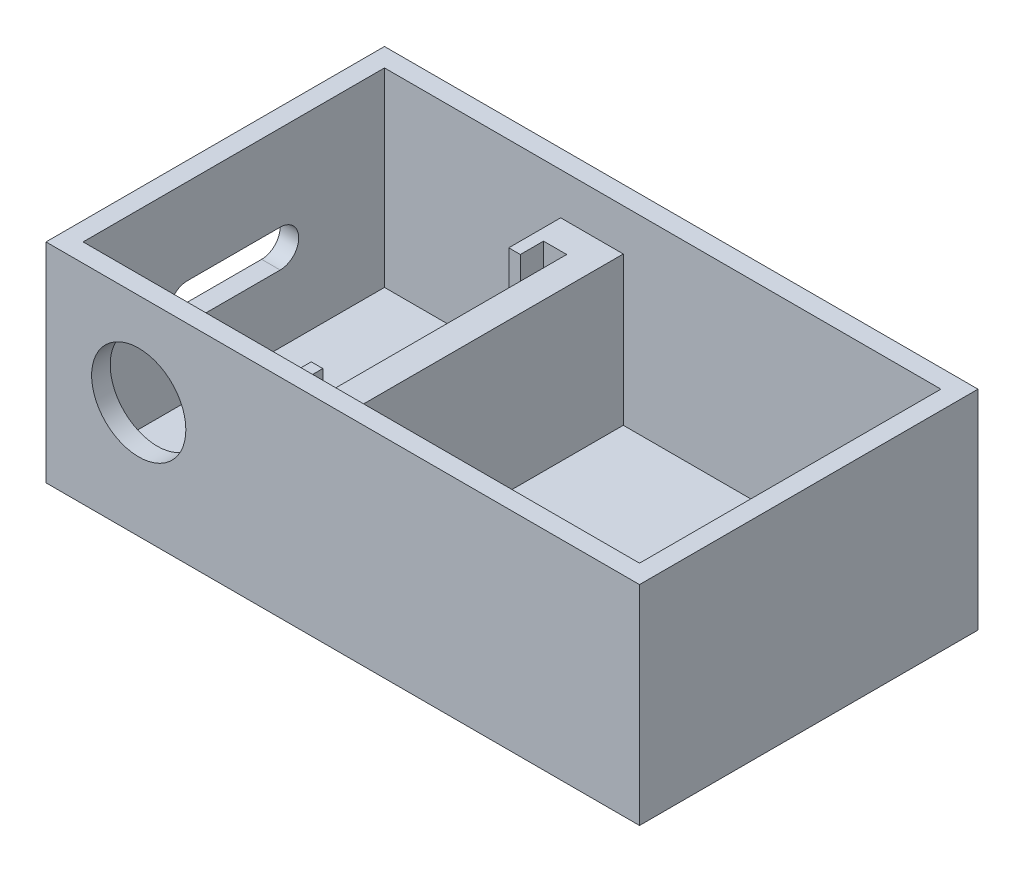
ISO-10303-21;
HEADER;
FILE_DESCRIPTION(('STEP AP214'),'2;1');
FILE_NAME('part.step','',(''),(''),'','','');
FILE_SCHEMA(('AUTOMOTIVE_DESIGN { 1 0 10303 214 1 1 1 1 }'));
ENDSEC;
DATA;
#1=APPLICATION_CONTEXT('core data for automotive mechanical design processes');
#2=APPLICATION_PROTOCOL_DEFINITION('international standard','automotive_design',2000,#1);
#3=PRODUCT_CONTEXT('',#1,'mechanical');
#4=PRODUCT('Part','Part','',(#3));
#5=PRODUCT_RELATED_PRODUCT_CATEGORY('part','',(#4));
#6=PRODUCT_DEFINITION_FORMATION('','',#4);
#7=PRODUCT_DEFINITION_CONTEXT('part definition',#1,'design');
#8=PRODUCT_DEFINITION('design','',#6,#7);
#9=PRODUCT_DEFINITION_SHAPE('','',#8);
#10=(LENGTH_UNIT() NAMED_UNIT(*) SI_UNIT(.MILLI.,.METRE.));
#11=(NAMED_UNIT(*) PLANE_ANGLE_UNIT() SI_UNIT($,.RADIAN.));
#12=(NAMED_UNIT(*) SI_UNIT($,.STERADIAN.) SOLID_ANGLE_UNIT());
#13=UNCERTAINTY_MEASURE_WITH_UNIT(LENGTH_MEASURE(1.E-05),#10,'distance_accuracy_value','');
#14=(GEOMETRIC_REPRESENTATION_CONTEXT(3) GLOBAL_UNCERTAINTY_ASSIGNED_CONTEXT((#13)) GLOBAL_UNIT_ASSIGNED_CONTEXT((#10,
#11,#12)) REPRESENTATION_CONTEXT('',''));
#15=CARTESIAN_POINT('',(0.,0.,0.));
#16=DIRECTION('',(0.,0.,1.));
#17=DIRECTION('',(1.,0.,0.));
#18=AXIS2_PLACEMENT_3D('',#15,#16,#17);
#19=CARTESIAN_POINT('',(0.,41.,-32.5));
#20=DIRECTION('',(0.,0.,1.));
#21=DIRECTION('',(1.,0.,0.));
#22=AXIS2_PLACEMENT_3D('',#19,#20,#21);
#23=PLANE('',#22);
#24=DIRECTION('',(-1.,0.,0.));
#25=VECTOR('',#24,1.);
#26=CARTESIAN_POINT('',(0.,0.,-32.5));
#27=LINE('',#26,#25);
#28=CARTESIAN_POINT('',(-22.,0.,-32.5));
#29=VERTEX_POINT('',#28);
#30=CARTESIAN_POINT('',(-60.,0.,-32.5));
#31=VERTEX_POINT('',#30);
#32=EDGE_CURVE('E351',#29,#31,#27,.T.);
#33=ORIENTED_EDGE('',*,*,#32,.F.);
#34=DIRECTION('',(0.,-1.,0.));
#35=VECTOR('',#34,1.);
#36=CARTESIAN_POINT('',(-22.,32.,-32.5));
#37=LINE('',#36,#35);
#38=CARTESIAN_POINT('',(-22.,32.,-32.5));
#39=VERTEX_POINT('',#38);
#40=EDGE_CURVE('E309',#39,#29,#37,.T.);
#41=ORIENTED_EDGE('',*,*,#40,.F.);
#42=DIRECTION('',(1.,0.,0.));
#43=VECTOR('',#42,1.);
#44=CARTESIAN_POINT('',(-14.5,32.,-32.5));
#45=LINE('',#44,#43);
#46=CARTESIAN_POINT('',(-8.50000000000001,32.,-32.5));
#47=VERTEX_POINT('',#46);
#48=EDGE_CURVE('E312',#39,#47,#45,.T.);
#49=ORIENTED_EDGE('',*,*,#48,.T.);
#50=DIRECTION('',(0.,-1.,0.));
#51=VECTOR('',#50,1.);
#52=CARTESIAN_POINT('',(-8.50000000000001,32.,-32.5));
#53=LINE('',#52,#51);
#54=CARTESIAN_POINT('',(-8.50000000000001,0.,-32.5));
#55=VERTEX_POINT('',#54);
#56=EDGE_CURVE('E324',#47,#55,#53,.T.);
#57=ORIENTED_EDGE('',*,*,#56,.T.);
#58=CARTESIAN_POINT('',(60.,0.,-32.5));
#59=VERTEX_POINT('',#58);
#60=EDGE_CURVE('E364',#59,#55,#27,.T.);
#61=ORIENTED_EDGE('',*,*,#60,.F.);
#62=DIRECTION('',(0.,-1.,0.));
#63=VECTOR('',#62,1.);
#64=CARTESIAN_POINT('',(60.,41.,-32.5));
#65=LINE('',#64,#63);
#66=CARTESIAN_POINT('',(60.,41.,-32.5));
#67=VERTEX_POINT('',#66);
#68=EDGE_CURVE('E363',#67,#59,#65,.T.);
#69=ORIENTED_EDGE('',*,*,#68,.F.);
#70=DIRECTION('',(-1.,0.,0.));
#71=VECTOR('',#70,1.);
#72=CARTESIAN_POINT('',(0.,41.,-32.5));
#73=LINE('',#72,#71);
#74=CARTESIAN_POINT('',(-60.,41.,-32.5));
#75=VERTEX_POINT('',#74);
#76=EDGE_CURVE('E352',#67,#75,#73,.T.);
#77=ORIENTED_EDGE('',*,*,#76,.T.);
#78=DIRECTION('',(0.,-1.,0.));
#79=VECTOR('',#78,1.);
#80=CARTESIAN_POINT('',(-60.,41.,-32.5));
#81=LINE('',#80,#79);
#82=EDGE_CURVE('E384',#75,#31,#81,.T.);
#83=ORIENTED_EDGE('',*,*,#82,.T.);
#84=EDGE_LOOP('',(#33,#41,#49,#57,#61,#69,#77,#83));
#85=FACE_BOUND('',#84,.T.);
#86=ADVANCED_FACE('F58',(#85),#23,.T.);
#87=CARTESIAN_POINT('',(0.,0.,0.));
#88=DIRECTION('',(0.,-1.,0.));
#89=DIRECTION('',(0.,0.,-1.));
#90=AXIS2_PLACEMENT_3D('',#87,#88,#89);
#91=PLANE('',#90);
#92=DIRECTION('',(0.,0.,1.));
#93=VECTOR('',#92,1.);
#94=CARTESIAN_POINT('',(-19.5,0.,21.3));
#95=LINE('',#94,#93);
#96=CARTESIAN_POINT('',(-19.5,0.,21.3));
#97=VERTEX_POINT('',#96);
#98=CARTESIAN_POINT('',(-19.5,0.,26.3));
#99=VERTEX_POINT('',#98);
#100=EDGE_CURVE('E261',#97,#99,#95,.T.);
#101=ORIENTED_EDGE('',*,*,#100,.T.);
#102=DIRECTION('',(1.,0.,0.));
#103=VECTOR('',#102,1.);
#104=CARTESIAN_POINT('',(-19.5,0.,26.3));
#105=LINE('',#104,#103);
#106=CARTESIAN_POINT('',(-14.5,0.,26.3));
#107=VERTEX_POINT('',#106);
#108=EDGE_CURVE('E258',#99,#107,#105,.T.);
#109=ORIENTED_EDGE('',*,*,#108,.T.);
#110=DIRECTION('',(0.,0.,1.));
#111=VECTOR('',#110,1.);
#112=CARTESIAN_POINT('',(-14.5,0.,-32.5));
#113=LINE('',#112,#111);
#114=CARTESIAN_POINT('',(-14.5,0.,-26.3));
#115=VERTEX_POINT('',#114);
#116=EDGE_CURVE('E316',#115,#107,#113,.T.);
#117=ORIENTED_EDGE('',*,*,#116,.F.);
#118=DIRECTION('',(1.,0.,0.));
#119=VECTOR('',#118,1.);
#120=CARTESIAN_POINT('',(-19.5,0.,-26.3));
#121=LINE('',#120,#119);
#122=CARTESIAN_POINT('',(-19.5,0.,-26.3));
#123=VERTEX_POINT('',#122);
#124=EDGE_CURVE('E284',#123,#115,#121,.T.);
#125=ORIENTED_EDGE('',*,*,#124,.F.);
#126=DIRECTION('',(0.,0.,-1.));
#127=VECTOR('',#126,1.);
#128=CARTESIAN_POINT('',(-19.5,0.,-21.3));
#129=LINE('',#128,#127);
#130=CARTESIAN_POINT('',(-19.5,0.,-21.3));
#131=VERTEX_POINT('',#130);
#132=EDGE_CURVE('E295',#131,#123,#129,.T.);
#133=ORIENTED_EDGE('',*,*,#132,.F.);
#134=DIRECTION('',(1.,0.,0.));
#135=VECTOR('',#134,1.);
#136=CARTESIAN_POINT('',(-22.,0.,-21.3));
#137=LINE('',#136,#135);
#138=CARTESIAN_POINT('',(-22.,0.,-21.3));
#139=VERTEX_POINT('',#138);
#140=EDGE_CURVE('E293',#139,#131,#137,.T.);
#141=ORIENTED_EDGE('',*,*,#140,.F.);
#142=DIRECTION('',(0.,0.,1.));
#143=VECTOR('',#142,1.);
#144=CARTESIAN_POINT('',(-22.,0.,-32.5));
#145=LINE('',#144,#143);
#146=EDGE_CURVE('E271',#29,#139,#145,.T.);
#147=ORIENTED_EDGE('',*,*,#146,.F.);
#148=ORIENTED_EDGE('',*,*,#32,.T.);
#149=DIRECTION('',(0.,0.,1.));
#150=VECTOR('',#149,1.);
#151=CARTESIAN_POINT('',(-60.,0.,0.));
#152=LINE('',#151,#150);
#153=CARTESIAN_POINT('',(-60.,0.,32.5));
#154=VERTEX_POINT('',#153);
#155=EDGE_CURVE('E367',#31,#154,#152,.T.);
#156=ORIENTED_EDGE('',*,*,#155,.T.);
#157=DIRECTION('',(-1.,0.,0.));
#158=VECTOR('',#157,1.);
#159=CARTESIAN_POINT('',(0.,0.,32.5));
#160=LINE('',#159,#158);
#161=CARTESIAN_POINT('',(-22.,0.,32.5));
#162=VERTEX_POINT('',#161);
#163=EDGE_CURVE('E370',#162,#154,#160,.T.);
#164=ORIENTED_EDGE('',*,*,#163,.F.);
#165=DIRECTION('',(0.,0.,-1.));
#166=VECTOR('',#165,1.);
#167=CARTESIAN_POINT('',(-22.,0.,32.5));
#168=LINE('',#167,#166);
#169=CARTESIAN_POINT('',(-22.,0.,21.3));
#170=VERTEX_POINT('',#169);
#171=EDGE_CURVE('E268',#162,#170,#168,.T.);
#172=ORIENTED_EDGE('',*,*,#171,.T.);
#173=DIRECTION('',(1.,0.,0.));
#174=VECTOR('',#173,1.);
#175=CARTESIAN_POINT('',(-22.,0.,21.3));
#176=LINE('',#175,#174);
#177=EDGE_CURVE('E265',#170,#97,#176,.T.);
#178=ORIENTED_EDGE('',*,*,#177,.T.);
#179=EDGE_LOOP('',(#101,#109,#117,#125,#133,#141,#147,#148,#156,#164,#172,#178));
#180=FACE_BOUND('',#179,.T.);
#181=ADVANCED_FACE('F429',(#180),#91,.F.);
#182=CARTESIAN_POINT('',(-14.5,32.,-32.5));
#183=DIRECTION('',(1.,0.,0.));
#184=DIRECTION('',(0.,0.,-1.));
#185=AXIS2_PLACEMENT_3D('',#182,#183,#184);
#186=PLANE('',#185);
#187=ORIENTED_EDGE('',*,*,#116,.T.);
#188=DIRECTION('',(0.,-1.,0.));
#189=VECTOR('',#188,1.);
#190=CARTESIAN_POINT('',(-14.5,32.,26.3));
#191=LINE('',#190,#189);
#192=CARTESIAN_POINT('',(-14.5,32.,26.3));
#193=VERTEX_POINT('',#192);
#194=EDGE_CURVE('E244',#193,#107,#191,.T.);
#195=ORIENTED_EDGE('',*,*,#194,.F.);
#196=DIRECTION('',(0.,0.,1.));
#197=VECTOR('',#196,1.);
#198=CARTESIAN_POINT('',(-14.5,32.,-32.5));
#199=LINE('',#198,#197);
#200=CARTESIAN_POINT('',(-14.5,32.,-26.3));
#201=VERTEX_POINT('',#200);
#202=EDGE_CURVE('E321',#201,#193,#199,.T.);
#203=ORIENTED_EDGE('',*,*,#202,.F.);
#204=DIRECTION('',(0.,-1.,0.));
#205=VECTOR('',#204,1.);
#206=CARTESIAN_POINT('',(-14.5,32.,-26.3));
#207=LINE('',#206,#205);
#208=EDGE_CURVE('E291',#201,#115,#207,.T.);
#209=ORIENTED_EDGE('',*,*,#208,.T.);
#210=EDGE_LOOP('',(#187,#195,#203,#209));
#211=FACE_BOUND('',#210,.T.);
#212=ADVANCED_FACE('F435',(#211),#186,.F.);
#213=CARTESIAN_POINT('',(0.,41.,32.5));
#214=DIRECTION('',(0.,0.,1.));
#215=DIRECTION('',(1.,0.,0.));
#216=AXIS2_PLACEMENT_3D('',#213,#214,#215);
#217=PLANE('',#216);
#218=CARTESIAN_POINT('',(-44.,21.,32.5));
#219=DIRECTION('',(0.,0.,1.));
#220=DIRECTION('',(1.,0.,0.));
#221=AXIS2_PLACEMENT_3D('',#218,#219,#220);
#222=CIRCLE('',#221,10.16);
#223=CARTESIAN_POINT('',(-33.84,21.,32.5));
#224=VERTEX_POINT('',#223);
#225=EDGE_CURVE('E334',#224,#224,#222,.T.);
#226=ORIENTED_EDGE('',*,*,#225,.T.);
#227=EDGE_LOOP('',(#226));
#228=FACE_BOUND('',#227,.T.);
#229=DIRECTION('',(1.,0.,0.));
#230=VECTOR('',#229,1.);
#231=CARTESIAN_POINT('',(-14.5,32.,32.5));
#232=LINE('',#231,#230);
#233=CARTESIAN_POINT('',(-22.,32.,32.5));
#234=VERTEX_POINT('',#233);
#235=CARTESIAN_POINT('',(-8.49999999999999,32.,32.5));
#236=VERTEX_POINT('',#235);
#237=EDGE_CURVE('E319',#234,#236,#232,.T.);
#238=ORIENTED_EDGE('',*,*,#237,.F.);
#239=DIRECTION('',(0.,-1.,0.));
#240=VECTOR('',#239,1.);
#241=CARTESIAN_POINT('',(-22.,32.,32.5));
#242=LINE('',#241,#240);
#243=EDGE_CURVE('E247',#234,#162,#242,.T.);
#244=ORIENTED_EDGE('',*,*,#243,.T.);
#245=ORIENTED_EDGE('',*,*,#163,.T.);
#246=DIRECTION('',(0.,-1.,0.));
#247=VECTOR('',#246,1.);
#248=CARTESIAN_POINT('',(-60.,41.,32.5));
#249=LINE('',#248,#247);
#250=CARTESIAN_POINT('',(-60.,41.,32.5));
#251=VERTEX_POINT('',#250);
#252=EDGE_CURVE('E381',#251,#154,#249,.T.);
#253=ORIENTED_EDGE('',*,*,#252,.F.);
#254=DIRECTION('',(-1.,0.,0.));
#255=VECTOR('',#254,1.);
#256=CARTESIAN_POINT('',(0.,41.,32.5));
#257=LINE('',#256,#255);
#258=CARTESIAN_POINT('',(60.,41.,32.5));
#259=VERTEX_POINT('',#258);
#260=EDGE_CURVE('E357',#259,#251,#257,.T.);
#261=ORIENTED_EDGE('',*,*,#260,.F.);
#262=DIRECTION('',(0.,-1.,0.));
#263=VECTOR('',#262,1.);
#264=CARTESIAN_POINT('',(60.,41.,32.5));
#265=LINE('',#264,#263);
#266=CARTESIAN_POINT('',(60.,0.,32.5));
#267=VERTEX_POINT('',#266);
#268=EDGE_CURVE('E378',#259,#267,#265,.T.);
#269=ORIENTED_EDGE('',*,*,#268,.T.);
#270=CARTESIAN_POINT('',(-8.5,0.,32.5));
#271=VERTEX_POINT('',#270);
#272=EDGE_CURVE('E371',#267,#271,#160,.T.);
#273=ORIENTED_EDGE('',*,*,#272,.T.);
#274=DIRECTION('',(0.,-1.,0.));
#275=VECTOR('',#274,1.);
#276=CARTESIAN_POINT('',(-8.49999999999999,32.,32.5));
#277=LINE('',#276,#275);
#278=EDGE_CURVE('E329',#236,#271,#277,.T.);
#279=ORIENTED_EDGE('',*,*,#278,.F.);
#280=EDGE_LOOP('',(#238,#244,#245,#253,#261,#269,#273,#279));
#281=FACE_BOUND('',#280,.T.);
#282=ADVANCED_FACE('F446',(#228,#281),#217,.F.);
#283=CARTESIAN_POINT('',(0.,41.,0.));
#284=DIRECTION('',(0.,-1.,0.));
#285=DIRECTION('',(0.,0.,-1.));
#286=AXIS2_PLACEMENT_3D('',#283,#284,#285);
#287=PLANE('',#286);
#288=DIRECTION('',(0.,0.,1.));
#289=VECTOR('',#288,1.);
#290=CARTESIAN_POINT('',(64.,41.,-36.5));
#291=LINE('',#290,#289);
#292=CARTESIAN_POINT('',(64.,41.,-36.5));
#293=VERTEX_POINT('',#292);
#294=CARTESIAN_POINT('',(64.,41.,36.5));
#295=VERTEX_POINT('',#294);
#296=EDGE_CURVE('E387',#293,#295,#291,.T.);
#297=ORIENTED_EDGE('',*,*,#296,.F.);
#298=DIRECTION('',(-1.,0.,0.));
#299=VECTOR('',#298,1.);
#300=CARTESIAN_POINT('',(64.,41.,-36.5));
#301=LINE('',#300,#299);
#302=CARTESIAN_POINT('',(-64.,41.,-36.5));
#303=VERTEX_POINT('',#302);
#304=EDGE_CURVE('E395',#293,#303,#301,.T.);
#305=ORIENTED_EDGE('',*,*,#304,.T.);
#306=DIRECTION('',(0.,0.,1.));
#307=VECTOR('',#306,1.);
#308=CARTESIAN_POINT('',(-64.,41.,-36.5));
#309=LINE('',#308,#307);
#310=CARTESIAN_POINT('',(-64.,41.,36.5));
#311=VERTEX_POINT('',#310);
#312=EDGE_CURVE('E393',#303,#311,#309,.T.);
#313=ORIENTED_EDGE('',*,*,#312,.T.);
#314=DIRECTION('',(-1.,0.,0.));
#315=VECTOR('',#314,1.);
#316=CARTESIAN_POINT('',(64.,41.,36.5));
#317=LINE('',#316,#315);
#318=EDGE_CURVE('E390',#295,#311,#317,.T.);
#319=ORIENTED_EDGE('',*,*,#318,.F.);
#320=EDGE_LOOP('',(#297,#305,#313,#319));
#321=FACE_BOUND('',#320,.T.);
#322=ORIENTED_EDGE('',*,*,#76,.F.);
#323=DIRECTION('',(0.,0.,1.));
#324=VECTOR('',#323,1.);
#325=CARTESIAN_POINT('',(60.,41.,0.));
#326=LINE('',#325,#324);
#327=EDGE_CURVE('E360',#67,#259,#326,.T.);
#328=ORIENTED_EDGE('',*,*,#327,.T.);
#329=ORIENTED_EDGE('',*,*,#260,.T.);
#330=DIRECTION('',(0.,0.,1.));
#331=VECTOR('',#330,1.);
#332=CARTESIAN_POINT('',(-60.,41.,0.));
#333=LINE('',#332,#331);
#334=EDGE_CURVE('E354',#75,#251,#333,.T.);
#335=ORIENTED_EDGE('',*,*,#334,.F.);
#336=EDGE_LOOP('',(#322,#328,#329,#335));
#337=FACE_BOUND('',#336,.T.);
#338=ADVANCED_FACE('F443',(#321,#337),#287,.F.);
#339=CARTESIAN_POINT('',(64.,41.,-36.5));
#340=DIRECTION('',(1.,0.,0.));
#341=DIRECTION('',(0.,0.,-1.));
#342=AXIS2_PLACEMENT_3D('',#339,#340,#341);
#343=PLANE('',#342);
#344=DIRECTION('',(0.,-1.,0.));
#345=VECTOR('',#344,1.);
#346=CARTESIAN_POINT('',(64.,41.,36.5));
#347=LINE('',#346,#345);
#348=CARTESIAN_POINT('',(64.,-4.,36.5));
#349=VERTEX_POINT('',#348);
#350=EDGE_CURVE('E397',#295,#349,#347,.T.);
#351=ORIENTED_EDGE('',*,*,#350,.T.);
#352=DIRECTION('',(0.,0.,1.));
#353=VECTOR('',#352,1.);
#354=CARTESIAN_POINT('',(64.,-4.,-36.5));
#355=LINE('',#354,#353);
#356=CARTESIAN_POINT('',(64.,-4.,-36.5));
#357=VERTEX_POINT('',#356);
#358=EDGE_CURVE('E337',#357,#349,#355,.T.);
#359=ORIENTED_EDGE('',*,*,#358,.F.);
#360=DIRECTION('',(0.,-1.,0.));
#361=VECTOR('',#360,1.);
#362=CARTESIAN_POINT('',(64.,41.,-36.5));
#363=LINE('',#362,#361);
#364=EDGE_CURVE('E398',#293,#357,#363,.T.);
#365=ORIENTED_EDGE('',*,*,#364,.F.);
#366=ORIENTED_EDGE('',*,*,#296,.T.);
#367=EDGE_LOOP('',(#351,#359,#365,#366));
#368=FACE_BOUND('',#367,.T.);
#369=ADVANCED_FACE('F60',(#368),#343,.T.);
#370=CARTESIAN_POINT('',(64.,41.,-36.5));
#371=DIRECTION('',(0.,0.,1.));
#372=DIRECTION('',(1.,0.,0.));
#373=AXIS2_PLACEMENT_3D('',#370,#371,#372);
#374=PLANE('',#373);
#375=ORIENTED_EDGE('',*,*,#364,.T.);
#376=DIRECTION('',(-1.,0.,0.));
#377=VECTOR('',#376,1.);
#378=CARTESIAN_POINT('',(64.,-4.,-36.5));
#379=LINE('',#378,#377);
#380=CARTESIAN_POINT('',(-64.,-4.,-36.5));
#381=VERTEX_POINT('',#380);
#382=EDGE_CURVE('E348',#357,#381,#379,.T.);
#383=ORIENTED_EDGE('',*,*,#382,.T.);
#384=DIRECTION('',(0.,-1.,0.));
#385=VECTOR('',#384,1.);
#386=CARTESIAN_POINT('',(-64.,41.,-36.5));
#387=LINE('',#386,#385);
#388=EDGE_CURVE('E401',#303,#381,#387,.T.);
#389=ORIENTED_EDGE('',*,*,#388,.F.);
#390=ORIENTED_EDGE('',*,*,#304,.F.);
#391=EDGE_LOOP('',(#375,#383,#389,#390));
#392=FACE_BOUND('',#391,.T.);
#393=ADVANCED_FACE('F448',(#392),#374,.F.);
#394=CARTESIAN_POINT('',(-64.,41.,-36.5));
#395=DIRECTION('',(1.,0.,0.));
#396=DIRECTION('',(0.,0.,-1.));
#397=AXIS2_PLACEMENT_3D('',#394,#395,#396);
#398=PLANE('',#397);
#399=DIRECTION('',(0.,0.,-1.));
#400=VECTOR('',#399,1.);
#401=CARTESIAN_POINT('',(-64.,22.5,10.));
#402=LINE('',#401,#400);
#403=CARTESIAN_POINT('',(-64.,22.5,10.));
#404=VERTEX_POINT('',#403);
#405=CARTESIAN_POINT('',(-64.,22.5,-9.99999999999999));
#406=VERTEX_POINT('',#405);
#407=EDGE_CURVE('E230',#404,#406,#402,.T.);
#408=ORIENTED_EDGE('',*,*,#407,.F.);
#409=CARTESIAN_POINT('',(-64.,18.5,10.));
#410=DIRECTION('',(-1.,0.,0.));
#411=DIRECTION('',(0.,0.,1.));
#412=AXIS2_PLACEMENT_3D('',#409,#410,#411);
#413=CIRCLE('',#412,4.);
#414=CARTESIAN_POINT('',(-64.,14.5,10.));
#415=VERTEX_POINT('',#414);
#416=EDGE_CURVE('E73',#415,#404,#413,.T.);
#417=ORIENTED_EDGE('',*,*,#416,.F.);
#418=DIRECTION('',(0.,0.,-1.));
#419=VECTOR('',#418,1.);
#420=CARTESIAN_POINT('',(-64.,14.5,10.));
#421=LINE('',#420,#419);
#422=CARTESIAN_POINT('',(-64.,14.5,-9.99999999999999));
#423=VERTEX_POINT('',#422);
#424=EDGE_CURVE('E237',#415,#423,#421,.T.);
#425=ORIENTED_EDGE('',*,*,#424,.T.);
#426=CARTESIAN_POINT('',(-64.,18.5,-9.99999999999999));
#427=DIRECTION('',(-1.,0.,0.));
#428=DIRECTION('',(0.,0.,1.));
#429=AXIS2_PLACEMENT_3D('',#426,#427,#428);
#430=CIRCLE('',#429,4.);
#431=EDGE_CURVE('E221',#406,#423,#430,.T.);
#432=ORIENTED_EDGE('',*,*,#431,.F.);
#433=EDGE_LOOP('',(#408,#417,#425,#432));
#434=FACE_BOUND('',#433,.T.);
#435=ORIENTED_EDGE('',*,*,#388,.T.);
#436=DIRECTION('',(0.,0.,1.));
#437=VECTOR('',#436,1.);
#438=CARTESIAN_POINT('',(-64.,-4.,-36.5));
#439=LINE('',#438,#437);
#440=CARTESIAN_POINT('',(-64.,-4.,36.5));
#441=VERTEX_POINT('',#440);
#442=EDGE_CURVE('E345',#381,#441,#439,.T.);
#443=ORIENTED_EDGE('',*,*,#442,.T.);
#444=DIRECTION('',(0.,-1.,0.));
#445=VECTOR('',#444,1.);
#446=CARTESIAN_POINT('',(-64.,41.,36.5));
#447=LINE('',#446,#445);
#448=EDGE_CURVE('E403',#311,#441,#447,.T.);
#449=ORIENTED_EDGE('',*,*,#448,.F.);
#450=ORIENTED_EDGE('',*,*,#312,.F.);
#451=EDGE_LOOP('',(#435,#443,#449,#450));
#452=FACE_BOUND('',#451,.T.);
#453=ADVANCED_FACE('F234',(#434,#452),#398,.F.);
#454=CARTESIAN_POINT('',(64.,41.,36.5));
#455=DIRECTION('',(0.,0.,1.));
#456=DIRECTION('',(1.,0.,0.));
#457=AXIS2_PLACEMENT_3D('',#454,#455,#456);
#458=PLANE('',#457);
#459=CARTESIAN_POINT('',(-44.,21.,36.5));
#460=DIRECTION('',(0.,0.,1.));
#461=DIRECTION('',(1.,0.,0.));
#462=AXIS2_PLACEMENT_3D('',#459,#460,#461);
#463=CIRCLE('',#462,10.16);
#464=CARTESIAN_POINT('',(-33.84,21.,36.5));
#465=VERTEX_POINT('',#464);
#466=EDGE_CURVE('E331',#465,#465,#463,.T.);
#467=ORIENTED_EDGE('',*,*,#466,.F.);
#468=EDGE_LOOP('',(#467));
#469=FACE_BOUND('',#468,.T.);
#470=ORIENTED_EDGE('',*,*,#448,.T.);
#471=DIRECTION('',(-1.,0.,0.));
#472=VECTOR('',#471,1.);
#473=CARTESIAN_POINT('',(64.,-4.,36.5));
#474=LINE('',#473,#472);
#475=EDGE_CURVE('E342',#349,#441,#474,.T.);
#476=ORIENTED_EDGE('',*,*,#475,.F.);
#477=ORIENTED_EDGE('',*,*,#350,.F.);
#478=ORIENTED_EDGE('',*,*,#318,.T.);
#479=EDGE_LOOP('',(#470,#476,#477,#478));
#480=FACE_BOUND('',#479,.T.);
#481=ADVANCED_FACE('F453',(#469,#480),#458,.T.);
#482=CARTESIAN_POINT('',(-60.,41.,0.));
#483=DIRECTION('',(1.,0.,0.));
#484=DIRECTION('',(0.,0.,-1.));
#485=AXIS2_PLACEMENT_3D('',#482,#483,#484);
#486=PLANE('',#485);
#487=CARTESIAN_POINT('',(-60.,18.5,10.));
#488=DIRECTION('',(1.,0.,0.));
#489=DIRECTION('',(0.,0.,-1.));
#490=AXIS2_PLACEMENT_3D('',#487,#488,#489);
#491=CIRCLE('',#490,4.);
#492=CARTESIAN_POINT('',(-60.,22.5,10.));
#493=VERTEX_POINT('',#492);
#494=CARTESIAN_POINT('',(-60.,14.5,10.));
#495=VERTEX_POINT('',#494);
#496=EDGE_CURVE('E12',#493,#495,#491,.T.);
#497=ORIENTED_EDGE('',*,*,#496,.F.);
#498=DIRECTION('',(0.,0.,1.));
#499=VECTOR('',#498,1.);
#500=CARTESIAN_POINT('',(-60.,22.5,0.));
#501=LINE('',#500,#499);
#502=CARTESIAN_POINT('',(-60.,22.5,-9.99999999999999));
#503=VERTEX_POINT('',#502);
#504=EDGE_CURVE('E400',#503,#493,#501,.T.);
#505=ORIENTED_EDGE('',*,*,#504,.F.);
#506=CARTESIAN_POINT('',(-60.,18.5,-9.99999999999999));
#507=DIRECTION('',(1.,0.,0.));
#508=DIRECTION('',(0.,0.,-1.));
#509=AXIS2_PLACEMENT_3D('',#506,#507,#508);
#510=CIRCLE('',#509,4.);
#511=CARTESIAN_POINT('',(-60.,14.5,-9.99999999999999));
#512=VERTEX_POINT('',#511);
#513=EDGE_CURVE('E224',#512,#503,#510,.T.);
#514=ORIENTED_EDGE('',*,*,#513,.F.);
#515=DIRECTION('',(0.,0.,1.));
#516=VECTOR('',#515,1.);
#517=CARTESIAN_POINT('',(-60.,14.5,0.));
#518=LINE('',#517,#516);
#519=EDGE_CURVE('E66',#512,#495,#518,.T.);
#520=ORIENTED_EDGE('',*,*,#519,.T.);
#521=EDGE_LOOP('',(#497,#505,#514,#520));
#522=FACE_BOUND('',#521,.T.);
#523=ORIENTED_EDGE('',*,*,#155,.F.);
#524=ORIENTED_EDGE('',*,*,#82,.F.);
#525=ORIENTED_EDGE('',*,*,#334,.T.);
#526=ORIENTED_EDGE('',*,*,#252,.T.);
#527=EDGE_LOOP('',(#523,#524,#525,#526));
#528=FACE_BOUND('',#527,.T.);
#529=ADVANCED_FACE('F410',(#522,#528),#486,.T.);
#530=CARTESIAN_POINT('',(60.,41.,0.));
#531=DIRECTION('',(1.,0.,0.));
#532=DIRECTION('',(0.,0.,-1.));
#533=AXIS2_PLACEMENT_3D('',#530,#531,#532);
#534=PLANE('',#533);
#535=DIRECTION('',(0.,0.,1.));
#536=VECTOR('',#535,1.);
#537=CARTESIAN_POINT('',(60.,0.,0.));
#538=LINE('',#537,#536);
#539=EDGE_CURVE('E355',#59,#267,#538,.T.);
#540=ORIENTED_EDGE('',*,*,#539,.T.);
#541=ORIENTED_EDGE('',*,*,#268,.F.);
#542=ORIENTED_EDGE('',*,*,#327,.F.);
#543=ORIENTED_EDGE('',*,*,#68,.T.);
#544=EDGE_LOOP('',(#540,#541,#542,#543));
#545=FACE_BOUND('',#544,.T.);
#546=ADVANCED_FACE('F459',(#545),#534,.F.);
#547=ORIENTED_EDGE('',*,*,#60,.T.);
#548=DIRECTION('',(0.,0.,1.));
#549=VECTOR('',#548,1.);
#550=CARTESIAN_POINT('',(-8.50000000000001,0.,-32.5));
#551=LINE('',#550,#549);
#552=EDGE_CURVE('E311',#55,#271,#551,.T.);
#553=ORIENTED_EDGE('',*,*,#552,.T.);
#554=ORIENTED_EDGE('',*,*,#272,.F.);
#555=ORIENTED_EDGE('',*,*,#539,.F.);
#556=EDGE_LOOP('',(#547,#553,#554,#555));
#557=FACE_BOUND('',#556,.T.);
#558=ADVANCED_FACE('F438',(#557),#91,.F.);
#559=CARTESIAN_POINT('',(0.,-4.,0.));
#560=DIRECTION('',(0.,-1.,0.));
#561=DIRECTION('',(0.,0.,-1.));
#562=AXIS2_PLACEMENT_3D('',#559,#560,#561);
#563=PLANE('',#562);
#564=ORIENTED_EDGE('',*,*,#358,.T.);
#565=ORIENTED_EDGE('',*,*,#475,.T.);
#566=ORIENTED_EDGE('',*,*,#442,.F.);
#567=ORIENTED_EDGE('',*,*,#382,.F.);
#568=EDGE_LOOP('',(#564,#565,#566,#567));
#569=FACE_BOUND('',#568,.T.);
#570=ADVANCED_FACE('F468',(#569),#563,.T.);
#571=CARTESIAN_POINT('',(-44.,21.,32.5));
#572=DIRECTION('',(0.,0.,1.));
#573=DIRECTION('',(1.,0.,0.));
#574=AXIS2_PLACEMENT_3D('',#571,#572,#573);
#575=CYLINDRICAL_SURFACE('',#574,10.16);
#576=ORIENTED_EDGE('',*,*,#225,.F.);
#577=EDGE_LOOP('',(#576));
#578=FACE_BOUND('',#577,.T.);
#579=ORIENTED_EDGE('',*,*,#466,.T.);
#580=EDGE_LOOP('',(#579));
#581=FACE_BOUND('',#580,.T.);
#582=ADVANCED_FACE('F520',(#578,#581),#575,.F.);
#583=CARTESIAN_POINT('',(-8.50000000000001,32.,-32.5));
#584=DIRECTION('',(1.,0.,0.));
#585=DIRECTION('',(0.,0.,-1.));
#586=AXIS2_PLACEMENT_3D('',#583,#584,#585);
#587=PLANE('',#586);
#588=ORIENTED_EDGE('',*,*,#552,.F.);
#589=ORIENTED_EDGE('',*,*,#56,.F.);
#590=DIRECTION('',(0.,0.,1.));
#591=VECTOR('',#590,1.);
#592=CARTESIAN_POINT('',(-8.50000000000001,32.,-32.5));
#593=LINE('',#592,#591);
#594=EDGE_CURVE('E315',#47,#236,#593,.T.);
#595=ORIENTED_EDGE('',*,*,#594,.T.);
#596=ORIENTED_EDGE('',*,*,#278,.T.);
#597=EDGE_LOOP('',(#588,#589,#595,#596));
#598=FACE_BOUND('',#597,.T.);
#599=ADVANCED_FACE('F499',(#598),#587,.T.);
#600=CARTESIAN_POINT('',(0.,32.,0.));
#601=DIRECTION('',(0.,-1.,0.));
#602=DIRECTION('',(0.,0.,-1.));
#603=AXIS2_PLACEMENT_3D('',#600,#601,#602);
#604=PLANE('',#603);
#605=ORIENTED_EDGE('',*,*,#48,.F.);
#606=DIRECTION('',(0.,0.,1.));
#607=VECTOR('',#606,1.);
#608=CARTESIAN_POINT('',(-22.,32.,-32.5));
#609=LINE('',#608,#607);
#610=CARTESIAN_POINT('',(-22.,32.,-21.3));
#611=VERTEX_POINT('',#610);
#612=EDGE_CURVE('E281',#39,#611,#609,.T.);
#613=ORIENTED_EDGE('',*,*,#612,.T.);
#614=DIRECTION('',(1.,0.,0.));
#615=VECTOR('',#614,1.);
#616=CARTESIAN_POINT('',(-22.,32.,-21.3));
#617=LINE('',#616,#615);
#618=CARTESIAN_POINT('',(-19.5,32.,-21.3));
#619=VERTEX_POINT('',#618);
#620=EDGE_CURVE('E283',#611,#619,#617,.T.);
#621=ORIENTED_EDGE('',*,*,#620,.T.);
#622=DIRECTION('',(0.,0.,-1.));
#623=VECTOR('',#622,1.);
#624=CARTESIAN_POINT('',(-19.5,32.,-21.3));
#625=LINE('',#624,#623);
#626=CARTESIAN_POINT('',(-19.5,32.,-26.3));
#627=VERTEX_POINT('',#626);
#628=EDGE_CURVE('E286',#619,#627,#625,.T.);
#629=ORIENTED_EDGE('',*,*,#628,.T.);
#630=DIRECTION('',(1.,0.,0.));
#631=VECTOR('',#630,1.);
#632=CARTESIAN_POINT('',(-19.5,32.,-26.3));
#633=LINE('',#632,#631);
#634=EDGE_CURVE('E288',#627,#201,#633,.T.);
#635=ORIENTED_EDGE('',*,*,#634,.T.);
#636=ORIENTED_EDGE('',*,*,#202,.T.);
#637=DIRECTION('',(1.,0.,0.));
#638=VECTOR('',#637,1.);
#639=CARTESIAN_POINT('',(-19.5,32.,26.3));
#640=LINE('',#639,#638);
#641=CARTESIAN_POINT('',(-19.5,32.,26.3));
#642=VERTEX_POINT('',#641);
#643=EDGE_CURVE('E250',#642,#193,#640,.T.);
#644=ORIENTED_EDGE('',*,*,#643,.F.);
#645=DIRECTION('',(0.,0.,1.));
#646=VECTOR('',#645,1.);
#647=CARTESIAN_POINT('',(-19.5,32.,21.3));
#648=LINE('',#647,#646);
#649=CARTESIAN_POINT('',(-19.5,32.,21.3));
#650=VERTEX_POINT('',#649);
#651=EDGE_CURVE('E273',#650,#642,#648,.T.);
#652=ORIENTED_EDGE('',*,*,#651,.F.);
#653=DIRECTION('',(1.,0.,0.));
#654=VECTOR('',#653,1.);
#655=CARTESIAN_POINT('',(-22.,32.,21.3));
#656=LINE('',#655,#654);
#657=CARTESIAN_POINT('',(-22.,32.,21.3));
#658=VERTEX_POINT('',#657);
#659=EDGE_CURVE('E276',#658,#650,#656,.T.);
#660=ORIENTED_EDGE('',*,*,#659,.F.);
#661=DIRECTION('',(0.,0.,-1.));
#662=VECTOR('',#661,1.);
#663=CARTESIAN_POINT('',(-22.,32.,32.5));
#664=LINE('',#663,#662);
#665=EDGE_CURVE('E262',#234,#658,#664,.T.);
#666=ORIENTED_EDGE('',*,*,#665,.F.);
#667=ORIENTED_EDGE('',*,*,#237,.T.);
#668=ORIENTED_EDGE('',*,*,#594,.F.);
#669=EDGE_LOOP('',(#605,#613,#621,#629,#635,#636,#644,#652,#660,#666,#667,#668));
#670=FACE_BOUND('',#669,.T.);
#671=ADVANCED_FACE('F493',(#670),#604,.F.);
#672=CARTESIAN_POINT('',(-22.,32.,-32.5));
#673=DIRECTION('',(1.,0.,0.));
#674=DIRECTION('',(0.,0.,-1.));
#675=AXIS2_PLACEMENT_3D('',#672,#673,#674);
#676=PLANE('',#675);
#677=ORIENTED_EDGE('',*,*,#146,.T.);
#678=DIRECTION('',(0.,-1.,0.));
#679=VECTOR('',#678,1.);
#680=CARTESIAN_POINT('',(-22.,32.,-21.3));
#681=LINE('',#680,#679);
#682=EDGE_CURVE('E306',#611,#139,#681,.T.);
#683=ORIENTED_EDGE('',*,*,#682,.F.);
#684=ORIENTED_EDGE('',*,*,#612,.F.);
#685=ORIENTED_EDGE('',*,*,#40,.T.);
#686=EDGE_LOOP('',(#677,#683,#684,#685));
#687=FACE_BOUND('',#686,.T.);
#688=ADVANCED_FACE('F489',(#687),#676,.F.);
#689=CARTESIAN_POINT('',(-22.,32.,-21.3));
#690=DIRECTION('',(0.,0.,-1.));
#691=DIRECTION('',(-1.,0.,0.));
#692=AXIS2_PLACEMENT_3D('',#689,#690,#691);
#693=PLANE('',#692);
#694=ORIENTED_EDGE('',*,*,#140,.T.);
#695=DIRECTION('',(0.,-1.,0.));
#696=VECTOR('',#695,1.);
#697=CARTESIAN_POINT('',(-19.5,32.,-21.3));
#698=LINE('',#697,#696);
#699=EDGE_CURVE('E303',#619,#131,#698,.T.);
#700=ORIENTED_EDGE('',*,*,#699,.F.);
#701=ORIENTED_EDGE('',*,*,#620,.F.);
#702=ORIENTED_EDGE('',*,*,#682,.T.);
#703=EDGE_LOOP('',(#694,#700,#701,#702));
#704=FACE_BOUND('',#703,.T.);
#705=ADVANCED_FACE('F534',(#704),#693,.F.);
#706=CARTESIAN_POINT('',(-19.5,32.,-21.3));
#707=DIRECTION('',(-1.,0.,0.));
#708=DIRECTION('',(0.,0.,1.));
#709=AXIS2_PLACEMENT_3D('',#706,#707,#708);
#710=PLANE('',#709);
#711=ORIENTED_EDGE('',*,*,#132,.T.);
#712=DIRECTION('',(0.,-1.,0.));
#713=VECTOR('',#712,1.);
#714=CARTESIAN_POINT('',(-19.5,32.,-26.3));
#715=LINE('',#714,#713);
#716=EDGE_CURVE('E300',#627,#123,#715,.T.);
#717=ORIENTED_EDGE('',*,*,#716,.F.);
#718=ORIENTED_EDGE('',*,*,#628,.F.);
#719=ORIENTED_EDGE('',*,*,#699,.T.);
#720=EDGE_LOOP('',(#711,#717,#718,#719));
#721=FACE_BOUND('',#720,.T.);
#722=ADVANCED_FACE('F537',(#721),#710,.F.);
#723=CARTESIAN_POINT('',(-19.5,32.,-26.3));
#724=DIRECTION('',(0.,0.,-1.));
#725=DIRECTION('',(-1.,0.,0.));
#726=AXIS2_PLACEMENT_3D('',#723,#724,#725);
#727=PLANE('',#726);
#728=ORIENTED_EDGE('',*,*,#124,.T.);
#729=ORIENTED_EDGE('',*,*,#208,.F.);
#730=ORIENTED_EDGE('',*,*,#634,.F.);
#731=ORIENTED_EDGE('',*,*,#716,.T.);
#732=EDGE_LOOP('',(#728,#729,#730,#731));
#733=FACE_BOUND('',#732,.T.);
#734=ADVANCED_FACE('F541',(#733),#727,.F.);
#735=CARTESIAN_POINT('',(-19.5,32.,26.3));
#736=DIRECTION('',(0.,0.,-1.));
#737=DIRECTION('',(-1.,0.,0.));
#738=AXIS2_PLACEMENT_3D('',#735,#736,#737);
#739=PLANE('',#738);
#740=ORIENTED_EDGE('',*,*,#108,.F.);
#741=DIRECTION('',(0.,-1.,0.));
#742=VECTOR('',#741,1.);
#743=CARTESIAN_POINT('',(-19.5,32.,26.3));
#744=LINE('',#743,#742);
#745=EDGE_CURVE('E255',#642,#99,#744,.T.);
#746=ORIENTED_EDGE('',*,*,#745,.F.);
#747=ORIENTED_EDGE('',*,*,#643,.T.);
#748=ORIENTED_EDGE('',*,*,#194,.T.);
#749=EDGE_LOOP('',(#740,#746,#747,#748));
#750=FACE_BOUND('',#749,.T.);
#751=ADVANCED_FACE('F545',(#750),#739,.T.);
#752=CARTESIAN_POINT('',(-19.5,32.,21.3));
#753=DIRECTION('',(1.,0.,0.));
#754=DIRECTION('',(0.,0.,-1.));
#755=AXIS2_PLACEMENT_3D('',#752,#753,#754);
#756=PLANE('',#755);
#757=ORIENTED_EDGE('',*,*,#100,.F.);
#758=DIRECTION('',(0.,-1.,0.));
#759=VECTOR('',#758,1.);
#760=CARTESIAN_POINT('',(-19.5,32.,21.3));
#761=LINE('',#760,#759);
#762=EDGE_CURVE('E253',#650,#97,#761,.T.);
#763=ORIENTED_EDGE('',*,*,#762,.F.);
#764=ORIENTED_EDGE('',*,*,#651,.T.);
#765=ORIENTED_EDGE('',*,*,#745,.T.);
#766=EDGE_LOOP('',(#757,#763,#764,#765));
#767=FACE_BOUND('',#766,.T.);
#768=ADVANCED_FACE('F549',(#767),#756,.T.);
#769=CARTESIAN_POINT('',(-22.,32.,21.3));
#770=DIRECTION('',(0.,0.,-1.));
#771=DIRECTION('',(-1.,0.,0.));
#772=AXIS2_PLACEMENT_3D('',#769,#770,#771);
#773=PLANE('',#772);
#774=ORIENTED_EDGE('',*,*,#177,.F.);
#775=DIRECTION('',(0.,-1.,0.));
#776=VECTOR('',#775,1.);
#777=CARTESIAN_POINT('',(-22.,32.,21.3));
#778=LINE('',#777,#776);
#779=EDGE_CURVE('E251',#658,#170,#778,.T.);
#780=ORIENTED_EDGE('',*,*,#779,.F.);
#781=ORIENTED_EDGE('',*,*,#659,.T.);
#782=ORIENTED_EDGE('',*,*,#762,.T.);
#783=EDGE_LOOP('',(#774,#780,#781,#782));
#784=FACE_BOUND('',#783,.T.);
#785=ADVANCED_FACE('F424',(#784),#773,.T.);
#786=CARTESIAN_POINT('',(-22.,32.,32.5));
#787=DIRECTION('',(-1.,0.,0.));
#788=DIRECTION('',(0.,0.,1.));
#789=AXIS2_PLACEMENT_3D('',#786,#787,#788);
#790=PLANE('',#789);
#791=ORIENTED_EDGE('',*,*,#171,.F.);
#792=ORIENTED_EDGE('',*,*,#243,.F.);
#793=ORIENTED_EDGE('',*,*,#665,.T.);
#794=ORIENTED_EDGE('',*,*,#779,.T.);
#795=EDGE_LOOP('',(#791,#792,#793,#794));
#796=FACE_BOUND('',#795,.T.);
#797=ADVANCED_FACE('F417',(#796),#790,.T.);
#798=CARTESIAN_POINT('',(-54.,18.5,10.));
#799=DIRECTION('',(-1.,0.,0.));
#800=DIRECTION('',(0.,0.,1.));
#801=AXIS2_PLACEMENT_3D('',#798,#799,#800);
#802=CYLINDRICAL_SURFACE('',#801,4.);
#803=ORIENTED_EDGE('',*,*,#496,.T.);
#804=DIRECTION('',(-1.,0.,0.));
#805=VECTOR('',#804,1.);
#806=CARTESIAN_POINT('',(-54.,14.5,10.));
#807=LINE('',#806,#805);
#808=EDGE_CURVE('E242',#495,#415,#807,.T.);
#809=ORIENTED_EDGE('',*,*,#808,.T.);
#810=ORIENTED_EDGE('',*,*,#416,.T.);
#811=DIRECTION('',(-1.,0.,0.));
#812=VECTOR('',#811,1.);
#813=CARTESIAN_POINT('',(-54.,22.5,10.));
#814=LINE('',#813,#812);
#815=EDGE_CURVE('E227',#493,#404,#814,.T.);
#816=ORIENTED_EDGE('',*,*,#815,.F.);
#817=EDGE_LOOP('',(#803,#809,#810,#816));
#818=FACE_BOUND('',#817,.T.);
#819=ADVANCED_FACE('F415',(#818),#802,.F.);
#820=CARTESIAN_POINT('',(-54.,14.5,10.));
#821=DIRECTION('',(0.,1.,0.));
#822=DIRECTION('',(0.,0.,1.));
#823=AXIS2_PLACEMENT_3D('',#820,#821,#822);
#824=PLANE('',#823);
#825=DIRECTION('',(-1.,0.,0.));
#826=VECTOR('',#825,1.);
#827=CARTESIAN_POINT('',(-54.,14.5,-9.99999999999999));
#828=LINE('',#827,#826);
#829=EDGE_CURVE('E226',#512,#423,#828,.T.);
#830=ORIENTED_EDGE('',*,*,#829,.T.);
#831=ORIENTED_EDGE('',*,*,#424,.F.);
#832=ORIENTED_EDGE('',*,*,#808,.F.);
#833=ORIENTED_EDGE('',*,*,#519,.F.);
#834=EDGE_LOOP('',(#830,#831,#832,#833));
#835=FACE_BOUND('',#834,.T.);
#836=ADVANCED_FACE('F414',(#835),#824,.T.);
#837=CARTESIAN_POINT('',(-54.,18.5,-9.99999999999999));
#838=DIRECTION('',(-1.,0.,0.));
#839=DIRECTION('',(0.,0.,1.));
#840=AXIS2_PLACEMENT_3D('',#837,#838,#839);
#841=CYLINDRICAL_SURFACE('',#840,4.);
#842=ORIENTED_EDGE('',*,*,#513,.T.);
#843=DIRECTION('',(-1.,0.,0.));
#844=VECTOR('',#843,1.);
#845=CARTESIAN_POINT('',(-54.,22.5,-9.99999999999999));
#846=LINE('',#845,#844);
#847=EDGE_CURVE('E81',#503,#406,#846,.T.);
#848=ORIENTED_EDGE('',*,*,#847,.T.);
#849=ORIENTED_EDGE('',*,*,#431,.T.);
#850=ORIENTED_EDGE('',*,*,#829,.F.);
#851=EDGE_LOOP('',(#842,#848,#849,#850));
#852=FACE_BOUND('',#851,.T.);
#853=ADVANCED_FACE('F218',(#852),#841,.F.);
#854=CARTESIAN_POINT('',(-54.,22.5,10.));
#855=DIRECTION('',(0.,1.,0.));
#856=DIRECTION('',(0.,0.,1.));
#857=AXIS2_PLACEMENT_3D('',#854,#855,#856);
#858=PLANE('',#857);
#859=ORIENTED_EDGE('',*,*,#504,.T.);
#860=ORIENTED_EDGE('',*,*,#815,.T.);
#861=ORIENTED_EDGE('',*,*,#407,.T.);
#862=ORIENTED_EDGE('',*,*,#847,.F.);
#863=EDGE_LOOP('',(#859,#860,#861,#862));
#864=FACE_BOUND('',#863,.T.);
#865=ADVANCED_FACE('F231',(#864),#858,.F.);
#866=CLOSED_SHELL('',(#86,#181,#212,#282,#338,#369,#393,#453,#481,#529,#546,#558,#570,#582,#599,
#671,#688,#705,#722,#734,#751,#768,#785,#797,#819,#836,#853,#865));
#867=MANIFOLD_SOLID_BREP('B2',#866);
#868=ADVANCED_BREP_SHAPE_REPRESENTATION('',(#18,#867),#14);
#869=SHAPE_DEFINITION_REPRESENTATION(#9,#868);
ENDSEC;
END-ISO-10303-21;
